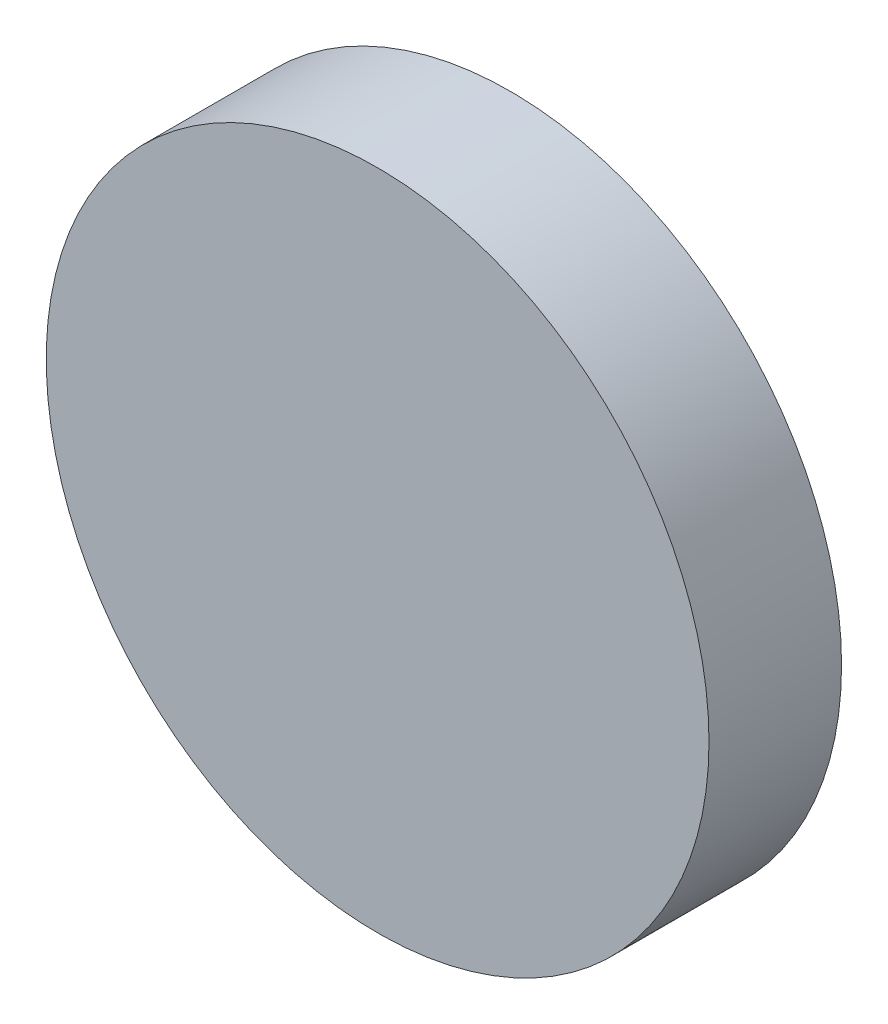
ISO-10303-21;
HEADER;
FILE_DESCRIPTION(('STEP AP214'),'2;1');
FILE_NAME('part.step','',(''),(''),'','','');
FILE_SCHEMA(('AUTOMOTIVE_DESIGN { 1 0 10303 214 1 1 1 1 }'));
ENDSEC;
DATA;
#1=APPLICATION_CONTEXT('core data for automotive mechanical design processes');
#2=APPLICATION_PROTOCOL_DEFINITION('international standard','automotive_design',2000,#1);
#3=PRODUCT_CONTEXT('',#1,'mechanical');
#4=PRODUCT('Part','Part','',(#3));
#5=PRODUCT_RELATED_PRODUCT_CATEGORY('part','',(#4));
#6=PRODUCT_DEFINITION_FORMATION('','',#4);
#7=PRODUCT_DEFINITION_CONTEXT('part definition',#1,'design');
#8=PRODUCT_DEFINITION('design','',#6,#7);
#9=PRODUCT_DEFINITION_SHAPE('','',#8);
#10=(LENGTH_UNIT() NAMED_UNIT(*) SI_UNIT(.MILLI.,.METRE.));
#11=(NAMED_UNIT(*) PLANE_ANGLE_UNIT() SI_UNIT($,.RADIAN.));
#12=(NAMED_UNIT(*) SI_UNIT($,.STERADIAN.) SOLID_ANGLE_UNIT());
#13=UNCERTAINTY_MEASURE_WITH_UNIT(LENGTH_MEASURE(1.E-05),#10,'distance_accuracy_value','');
#14=(GEOMETRIC_REPRESENTATION_CONTEXT(3) GLOBAL_UNCERTAINTY_ASSIGNED_CONTEXT((#13)) GLOBAL_UNIT_ASSIGNED_CONTEXT((#10,
#11,#12)) REPRESENTATION_CONTEXT('',''));
#15=CARTESIAN_POINT('',(0.,0.,0.));
#16=DIRECTION('',(0.,0.,1.));
#17=DIRECTION('',(1.,0.,0.));
#18=AXIS2_PLACEMENT_3D('',#15,#16,#17);
#19=CARTESIAN_POINT('',(0.,0.,4.));
#20=DIRECTION('',(0.,0.,-1.));
#21=DIRECTION('',(-1.,0.,0.));
#22=AXIS2_PLACEMENT_3D('',#19,#20,#21);
#23=CYLINDRICAL_SURFACE('',#22,10.);
#24=CARTESIAN_POINT('',(0.,0.,4.));
#25=DIRECTION('',(0.,0.,1.));
#26=DIRECTION('',(1.,0.,0.));
#27=AXIS2_PLACEMENT_3D('',#24,#25,#26);
#28=CIRCLE('',#27,10.);
#29=CARTESIAN_POINT('',(10.,0.,4.));
#30=VERTEX_POINT('',#29);
#31=EDGE_CURVE('E10',#30,#30,#28,.T.);
#32=ORIENTED_EDGE('',*,*,#31,.F.);
#33=EDGE_LOOP('',(#32));
#34=FACE_BOUND('',#33,.T.);
#35=CARTESIAN_POINT('',(0.,0.,0.));
#36=DIRECTION('',(0.,0.,1.));
#37=DIRECTION('',(1.,0.,0.));
#38=AXIS2_PLACEMENT_3D('',#35,#36,#37);
#39=CIRCLE('',#38,10.);
#40=CARTESIAN_POINT('',(10.,0.,0.));
#41=VERTEX_POINT('',#40);
#42=EDGE_CURVE('E42',#41,#41,#39,.T.);
#43=ORIENTED_EDGE('',*,*,#42,.T.);
#44=EDGE_LOOP('',(#43));
#45=FACE_BOUND('',#44,.T.);
#46=ADVANCED_FACE('F39',(#34,#45),#23,.T.);
#47=CARTESIAN_POINT('',(0.,0.,4.));
#48=DIRECTION('',(0.,0.,1.));
#49=DIRECTION('',(1.,0.,0.));
#50=AXIS2_PLACEMENT_3D('',#47,#48,#49);
#51=PLANE('',#50);
#52=ORIENTED_EDGE('',*,*,#31,.T.);
#53=EDGE_LOOP('',(#52));
#54=FACE_BOUND('',#53,.T.);
#55=ADVANCED_FACE('F56',(#54),#51,.T.);
#56=CARTESIAN_POINT('',(0.,0.,0.));
#57=DIRECTION('',(0.,0.,1.));
#58=DIRECTION('',(1.,0.,0.));
#59=AXIS2_PLACEMENT_3D('',#56,#57,#58);
#60=PLANE('',#59);
#61=ORIENTED_EDGE('',*,*,#42,.F.);
#62=EDGE_LOOP('',(#61));
#63=FACE_BOUND('',#62,.T.);
#64=ADVANCED_FACE('F54',(#63),#60,.F.);
#65=CLOSED_SHELL('',(#46,#55,#64));
#66=MANIFOLD_SOLID_BREP('B2',#65);
#67=ADVANCED_BREP_SHAPE_REPRESENTATION('',(#18,#66),#14);
#68=SHAPE_DEFINITION_REPRESENTATION(#9,#67);
ENDSEC;
END-ISO-10303-21;
